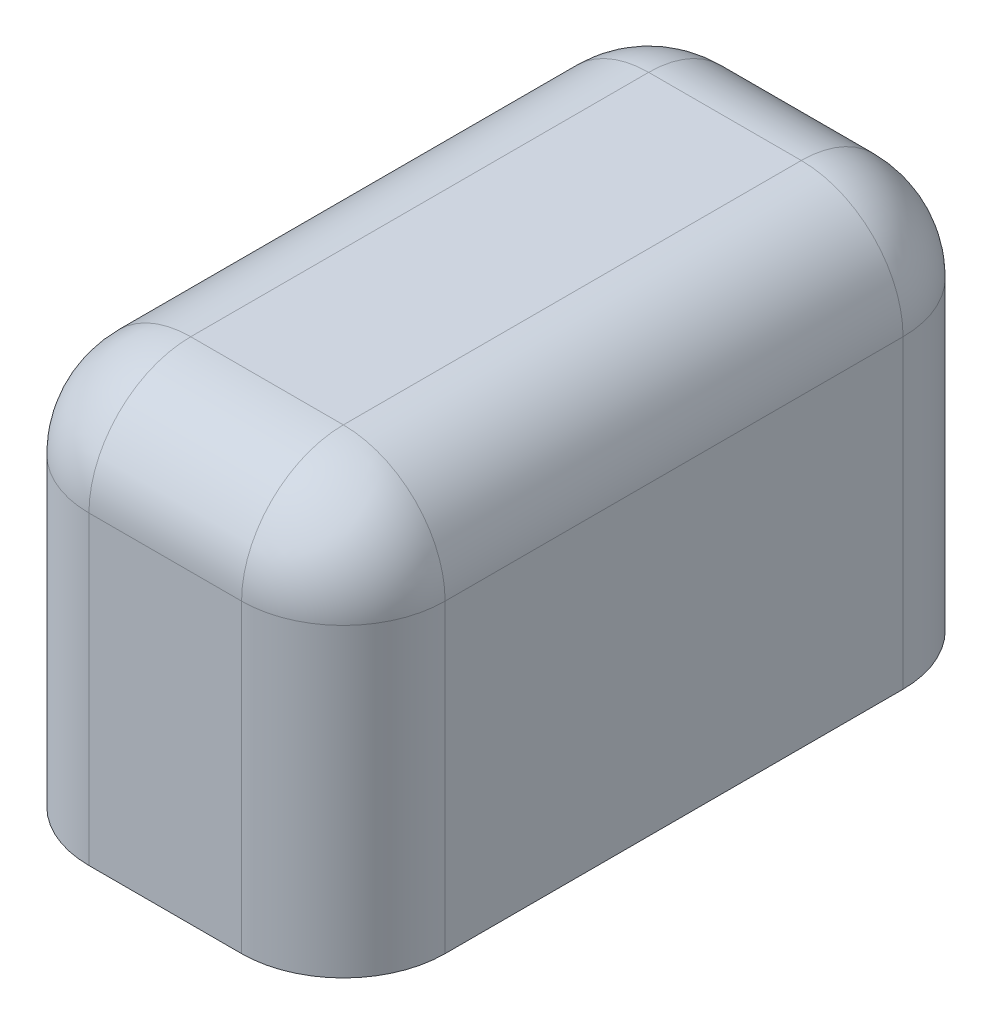
ISO-10303-21;
HEADER;
FILE_DESCRIPTION(('STEP AP214'),'2;1');
FILE_NAME('part.step','',(''),(''),'','','');
FILE_SCHEMA(('AUTOMOTIVE_DESIGN { 1 0 10303 214 1 1 1 1 }'));
ENDSEC;
DATA;
#1=APPLICATION_CONTEXT('core data for automotive mechanical design processes');
#2=APPLICATION_PROTOCOL_DEFINITION('international standard','automotive_design',2000,#1);
#3=PRODUCT_CONTEXT('',#1,'mechanical');
#4=PRODUCT('Part','Part','',(#3));
#5=PRODUCT_RELATED_PRODUCT_CATEGORY('part','',(#4));
#6=PRODUCT_DEFINITION_FORMATION('','',#4);
#7=PRODUCT_DEFINITION_CONTEXT('part definition',#1,'design');
#8=PRODUCT_DEFINITION('design','',#6,#7);
#9=PRODUCT_DEFINITION_SHAPE('','',#8);
#10=(LENGTH_UNIT() NAMED_UNIT(*) SI_UNIT(.MILLI.,.METRE.));
#11=(NAMED_UNIT(*) PLANE_ANGLE_UNIT() SI_UNIT($,.RADIAN.));
#12=(NAMED_UNIT(*) SI_UNIT($,.STERADIAN.) SOLID_ANGLE_UNIT());
#13=UNCERTAINTY_MEASURE_WITH_UNIT(LENGTH_MEASURE(1.E-05),#10,'distance_accuracy_value','');
#14=(GEOMETRIC_REPRESENTATION_CONTEXT(3) GLOBAL_UNCERTAINTY_ASSIGNED_CONTEXT((#13)) GLOBAL_UNIT_ASSIGNED_CONTEXT((#10,
#11,#12)) REPRESENTATION_CONTEXT('',''));
#15=CARTESIAN_POINT('',(0.,0.,0.));
#16=DIRECTION('',(0.,0.,1.));
#17=DIRECTION('',(1.,0.,0.));
#18=AXIS2_PLACEMENT_3D('',#15,#16,#17);
#19=CARTESIAN_POINT('',(4.445,0.,0.));
#20=DIRECTION('',(0.,0.,-1.));
#21=DIRECTION('',(-1.,0.,0.));
#22=AXIS2_PLACEMENT_3D('',#19,#20,#21);
#23=PLANE('',#22);
#24=DIRECTION('',(-1.,0.,0.));
#25=VECTOR('',#24,1.);
#26=CARTESIAN_POINT('',(4.445,7.62,0.));
#27=LINE('',#26,#25);
#28=CARTESIAN_POINT('',(1.905,7.62,0.));
#29=VERTEX_POINT('',#28);
#30=CARTESIAN_POINT('',(-1.905,7.62,0.));
#31=VERTEX_POINT('',#30);
#32=EDGE_CURVE('E135',#29,#31,#27,.T.);
#33=ORIENTED_EDGE('',*,*,#32,.T.);
#34=DIRECTION('',(0.,-1.,0.));
#35=VECTOR('',#34,1.);
#36=CARTESIAN_POINT('',(-1.905,0.,0.));
#37=LINE('',#36,#35);
#38=CARTESIAN_POINT('',(-1.905,0.,0.));
#39=VERTEX_POINT('',#38);
#40=EDGE_CURVE('E177',#31,#39,#37,.T.);
#41=ORIENTED_EDGE('',*,*,#40,.T.);
#42=DIRECTION('',(-1.,0.,0.));
#43=VECTOR('',#42,1.);
#44=CARTESIAN_POINT('',(4.445,0.,0.));
#45=LINE('',#44,#43);
#46=CARTESIAN_POINT('',(1.905,0.,0.));
#47=VERTEX_POINT('',#46);
#48=EDGE_CURVE('E151',#47,#39,#45,.T.);
#49=ORIENTED_EDGE('',*,*,#48,.F.);
#50=DIRECTION('',(0.,-1.,0.));
#51=VECTOR('',#50,1.);
#52=CARTESIAN_POINT('',(1.905,0.,0.));
#53=LINE('',#52,#51);
#54=EDGE_CURVE('E174',#47,#29,#53,.F.);
#55=ORIENTED_EDGE('',*,*,#54,.T.);
#56=EDGE_LOOP('',(#33,#41,#49,#55));
#57=FACE_BOUND('',#56,.T.);
#58=ADVANCED_FACE('F41',(#57),#23,.F.);
#59=CARTESIAN_POINT('',(4.445,0.,0.));
#60=DIRECTION('',(0.,1.,0.));
#61=DIRECTION('',(0.,0.,1.));
#62=AXIS2_PLACEMENT_3D('',#59,#60,#61);
#63=PLANE('',#62);
#64=DIRECTION('',(-1.,0.,0.));
#65=VECTOR('',#64,1.);
#66=CARTESIAN_POINT('',(4.445,0.,-16.51));
#67=LINE('',#66,#65);
#68=CARTESIAN_POINT('',(1.905,0.,-16.51));
#69=VERTEX_POINT('',#68);
#70=CARTESIAN_POINT('',(-1.905,0.,-16.51));
#71=VERTEX_POINT('',#70);
#72=EDGE_CURVE('E154',#69,#71,#67,.T.);
#73=ORIENTED_EDGE('',*,*,#72,.F.);
#74=CARTESIAN_POINT('',(1.905,0.,-13.97));
#75=DIRECTION('',(0.,1.,0.));
#76=DIRECTION('',(0.,0.,1.));
#77=AXIS2_PLACEMENT_3D('',#74,#75,#76);
#78=CIRCLE('',#77,2.54);
#79=CARTESIAN_POINT('',(4.445,0.,-13.97));
#80=VERTEX_POINT('',#79);
#81=EDGE_CURVE('E11',#69,#80,#78,.F.);
#82=ORIENTED_EDGE('',*,*,#81,.T.);
#83=DIRECTION('',(0.,0.,-1.));
#84=VECTOR('',#83,1.);
#85=CARTESIAN_POINT('',(4.445,0.,0.));
#86=LINE('',#85,#84);
#87=CARTESIAN_POINT('',(4.445,0.,-2.54));
#88=VERTEX_POINT('',#87);
#89=EDGE_CURVE('E235',#88,#80,#86,.T.);
#90=ORIENTED_EDGE('',*,*,#89,.F.);
#91=CARTESIAN_POINT('',(1.905,0.,-2.54));
#92=DIRECTION('',(0.,1.,0.));
#93=DIRECTION('',(0.,0.,1.));
#94=AXIS2_PLACEMENT_3D('',#91,#92,#93);
#95=CIRCLE('',#94,2.54);
#96=EDGE_CURVE('E183',#88,#47,#95,.F.);
#97=ORIENTED_EDGE('',*,*,#96,.T.);
#98=ORIENTED_EDGE('',*,*,#48,.T.);
#99=CARTESIAN_POINT('',(-1.905,0.,-2.54));
#100=DIRECTION('',(0.,1.,0.));
#101=DIRECTION('',(0.,0.,1.));
#102=AXIS2_PLACEMENT_3D('',#99,#100,#101);
#103=CIRCLE('',#102,2.54);
#104=CARTESIAN_POINT('',(-4.445,0.,-2.54));
#105=VERTEX_POINT('',#104);
#106=EDGE_CURVE('E185',#39,#105,#103,.F.);
#107=ORIENTED_EDGE('',*,*,#106,.T.);
#108=DIRECTION('',(0.,0.,-1.));
#109=VECTOR('',#108,1.);
#110=CARTESIAN_POINT('',(-4.445,0.,0.));
#111=LINE('',#110,#109);
#112=CARTESIAN_POINT('',(-4.445,0.,-13.97));
#113=VERTEX_POINT('',#112);
#114=EDGE_CURVE('E231',#105,#113,#111,.T.);
#115=ORIENTED_EDGE('',*,*,#114,.T.);
#116=CARTESIAN_POINT('',(-1.905,0.,-13.97));
#117=DIRECTION('',(0.,1.,0.));
#118=DIRECTION('',(0.,0.,1.));
#119=AXIS2_PLACEMENT_3D('',#116,#117,#118);
#120=CIRCLE('',#119,2.54);
#121=EDGE_CURVE('E50',#113,#71,#120,.F.);
#122=ORIENTED_EDGE('',*,*,#121,.T.);
#123=EDGE_LOOP('',(#73,#82,#90,#97,#98,#107,#115,#122));
#124=FACE_BOUND('',#123,.T.);
#125=ADVANCED_FACE('F229',(#124),#63,.F.);
#126=CARTESIAN_POINT('',(4.445,0.,-16.51));
#127=DIRECTION('',(0.,0.,1.));
#128=DIRECTION('',(1.,0.,0.));
#129=AXIS2_PLACEMENT_3D('',#126,#127,#128);
#130=PLANE('',#129);
#131=DIRECTION('',(-1.,0.,0.));
#132=VECTOR('',#131,1.);
#133=CARTESIAN_POINT('',(4.445,7.62,-16.51));
#134=LINE('',#133,#132);
#135=CARTESIAN_POINT('',(-1.905,7.62,-16.51));
#136=VERTEX_POINT('',#135);
#137=CARTESIAN_POINT('',(1.905,7.62,-16.51));
#138=VERTEX_POINT('',#137);
#139=EDGE_CURVE('E163',#136,#138,#134,.F.);
#140=ORIENTED_EDGE('',*,*,#139,.T.);
#141=DIRECTION('',(0.,1.,0.));
#142=VECTOR('',#141,1.);
#143=CARTESIAN_POINT('',(1.905,0.,-16.51));
#144=LINE('',#143,#142);
#145=EDGE_CURVE('E166',#138,#69,#144,.F.);
#146=ORIENTED_EDGE('',*,*,#145,.T.);
#147=ORIENTED_EDGE('',*,*,#72,.T.);
#148=DIRECTION('',(0.,1.,0.));
#149=VECTOR('',#148,1.);
#150=CARTESIAN_POINT('',(-1.905,10.16,-16.51));
#151=LINE('',#150,#149);
#152=EDGE_CURVE('E161',#71,#136,#151,.T.);
#153=ORIENTED_EDGE('',*,*,#152,.T.);
#154=EDGE_LOOP('',(#140,#146,#147,#153));
#155=FACE_BOUND('',#154,.T.);
#156=ADVANCED_FACE('F233',(#155),#130,.F.);
#157=CARTESIAN_POINT('',(4.445,10.16,0.));
#158=DIRECTION('',(0.,-1.,0.));
#159=DIRECTION('',(0.,0.,-1.));
#160=AXIS2_PLACEMENT_3D('',#157,#158,#159);
#161=PLANE('',#160);
#162=DIRECTION('',(0.,0.,1.));
#163=VECTOR('',#162,1.);
#164=CARTESIAN_POINT('',(1.905,10.16,0.));
#165=LINE('',#164,#163);
#166=CARTESIAN_POINT('',(1.905,10.16,-2.54));
#167=VERTEX_POINT('',#166);
#168=CARTESIAN_POINT('',(1.905,10.16,-13.97));
#169=VERTEX_POINT('',#168);
#170=EDGE_CURVE('E122',#167,#169,#165,.F.);
#171=ORIENTED_EDGE('',*,*,#170,.T.);
#172=DIRECTION('',(-1.,0.,0.));
#173=VECTOR('',#172,1.);
#174=CARTESIAN_POINT('',(4.445,10.16,-13.97));
#175=LINE('',#174,#173);
#176=CARTESIAN_POINT('',(-1.905,10.16,-13.97));
#177=VERTEX_POINT('',#176);
#178=EDGE_CURVE('E159',#169,#177,#175,.T.);
#179=ORIENTED_EDGE('',*,*,#178,.T.);
#180=DIRECTION('',(0.,0.,1.));
#181=VECTOR('',#180,1.);
#182=CARTESIAN_POINT('',(-1.905,10.16,0.));
#183=LINE('',#182,#181);
#184=CARTESIAN_POINT('',(-1.905,10.16,-2.54));
#185=VERTEX_POINT('',#184);
#186=EDGE_CURVE('E125',#177,#185,#183,.T.);
#187=ORIENTED_EDGE('',*,*,#186,.T.);
#188=DIRECTION('',(-1.,0.,0.));
#189=VECTOR('',#188,1.);
#190=CARTESIAN_POINT('',(4.445,10.16,-2.54));
#191=LINE('',#190,#189);
#192=EDGE_CURVE('E117',#185,#167,#191,.F.);
#193=ORIENTED_EDGE('',*,*,#192,.T.);
#194=EDGE_LOOP('',(#171,#179,#187,#193));
#195=FACE_BOUND('',#194,.T.);
#196=ADVANCED_FACE('F119',(#195),#161,.F.);
#197=CARTESIAN_POINT('',(4.445,0.,0.));
#198=DIRECTION('',(-1.,0.,0.));
#199=DIRECTION('',(0.,0.,1.));
#200=AXIS2_PLACEMENT_3D('',#197,#198,#199);
#201=PLANE('',#200);
#202=ORIENTED_EDGE('',*,*,#89,.T.);
#203=DIRECTION('',(0.,1.,0.));
#204=VECTOR('',#203,1.);
#205=CARTESIAN_POINT('',(4.445,0.,-13.97));
#206=LINE('',#205,#204);
#207=CARTESIAN_POINT('',(4.445,7.62,-13.97));
#208=VERTEX_POINT('',#207);
#209=EDGE_CURVE('E58',#80,#208,#206,.T.);
#210=ORIENTED_EDGE('',*,*,#209,.T.);
#211=DIRECTION('',(0.,0.,1.));
#212=VECTOR('',#211,1.);
#213=CARTESIAN_POINT('',(4.445,7.62,0.));
#214=LINE('',#213,#212);
#215=CARTESIAN_POINT('',(4.445,7.62,-2.54));
#216=VERTEX_POINT('',#215);
#217=EDGE_CURVE('E62',#208,#216,#214,.T.);
#218=ORIENTED_EDGE('',*,*,#217,.T.);
#219=DIRECTION('',(0.,-1.,0.));
#220=VECTOR('',#219,1.);
#221=CARTESIAN_POINT('',(4.445,0.,-2.54));
#222=LINE('',#221,#220);
#223=EDGE_CURVE('E179',#216,#88,#222,.T.);
#224=ORIENTED_EDGE('',*,*,#223,.T.);
#225=EDGE_LOOP('',(#202,#210,#218,#224));
#226=FACE_BOUND('',#225,.T.);
#227=ADVANCED_FACE('F239',(#226),#201,.F.);
#228=CARTESIAN_POINT('',(-4.445,0.,0.));
#229=DIRECTION('',(-1.,0.,0.));
#230=DIRECTION('',(0.,0.,1.));
#231=AXIS2_PLACEMENT_3D('',#228,#229,#230);
#232=PLANE('',#231);
#233=DIRECTION('',(0.,0.,1.));
#234=VECTOR('',#233,1.);
#235=CARTESIAN_POINT('',(-4.445,7.62,-16.51));
#236=LINE('',#235,#234);
#237=CARTESIAN_POINT('',(-4.445,7.62,-2.54));
#238=VERTEX_POINT('',#237);
#239=CARTESIAN_POINT('',(-4.445,7.62,-13.97));
#240=VERTEX_POINT('',#239);
#241=EDGE_CURVE('E170',#238,#240,#236,.F.);
#242=ORIENTED_EDGE('',*,*,#241,.T.);
#243=DIRECTION('',(0.,1.,0.));
#244=VECTOR('',#243,1.);
#245=CARTESIAN_POINT('',(-4.445,0.,-13.97));
#246=LINE('',#245,#244);
#247=EDGE_CURVE('E172',#240,#113,#246,.F.);
#248=ORIENTED_EDGE('',*,*,#247,.T.);
#249=ORIENTED_EDGE('',*,*,#114,.F.);
#250=DIRECTION('',(0.,-1.,0.));
#251=VECTOR('',#250,1.);
#252=CARTESIAN_POINT('',(-4.445,10.16,-2.54));
#253=LINE('',#252,#251);
#254=EDGE_CURVE('E168',#105,#238,#253,.F.);
#255=ORIENTED_EDGE('',*,*,#254,.T.);
#256=EDGE_LOOP('',(#242,#248,#249,#255));
#257=FACE_BOUND('',#256,.T.);
#258=ADVANCED_FACE('F216',(#257),#232,.T.);
#259=CARTESIAN_POINT('',(1.905,0.,-2.54));
#260=DIRECTION('',(0.,-1.,0.));
#261=DIRECTION('',(0.,0.,-1.));
#262=AXIS2_PLACEMENT_3D('',#259,#260,#261);
#263=CYLINDRICAL_SURFACE('',#262,2.54);
#264=ORIENTED_EDGE('',*,*,#96,.F.);
#265=ORIENTED_EDGE('',*,*,#223,.F.);
#266=CARTESIAN_POINT('',(1.905,7.62,-2.54));
#267=DIRECTION('',(0.,1.,0.));
#268=DIRECTION('',(0.,0.,1.));
#269=AXIS2_PLACEMENT_3D('',#266,#267,#268);
#270=CIRCLE('',#269,2.54);
#271=EDGE_CURVE('E45',#29,#216,#270,.T.);
#272=ORIENTED_EDGE('',*,*,#271,.F.);
#273=ORIENTED_EDGE('',*,*,#54,.F.);
#274=EDGE_LOOP('',(#264,#265,#272,#273));
#275=FACE_BOUND('',#274,.T.);
#276=ADVANCED_FACE('F43',(#275),#263,.T.);
#277=CARTESIAN_POINT('',(4.445,7.62,-2.54));
#278=DIRECTION('',(-1.,0.,0.));
#279=DIRECTION('',(0.,0.,1.));
#280=AXIS2_PLACEMENT_3D('',#277,#278,#279);
#281=CYLINDRICAL_SURFACE('',#280,2.54);
#282=CARTESIAN_POINT('',(-1.905,7.62,-2.54));
#283=DIRECTION('',(-1.,0.,0.));
#284=DIRECTION('',(0.,0.,1.));
#285=AXIS2_PLACEMENT_3D('',#282,#283,#284);
#286=CIRCLE('',#285,2.54);
#287=EDGE_CURVE('E139',#31,#185,#286,.T.);
#288=ORIENTED_EDGE('',*,*,#287,.F.);
#289=ORIENTED_EDGE('',*,*,#32,.F.);
#290=CARTESIAN_POINT('',(1.905,7.62,-2.54));
#291=DIRECTION('',(1.,0.,0.));
#292=DIRECTION('',(0.,0.,-1.));
#293=AXIS2_PLACEMENT_3D('',#290,#291,#292);
#294=CIRCLE('',#293,2.54);
#295=EDGE_CURVE('E132',#167,#29,#294,.T.);
#296=ORIENTED_EDGE('',*,*,#295,.F.);
#297=ORIENTED_EDGE('',*,*,#192,.F.);
#298=EDGE_LOOP('',(#288,#289,#296,#297));
#299=FACE_BOUND('',#298,.T.);
#300=ADVANCED_FACE('F134',(#299),#281,.T.);
#301=CARTESIAN_POINT('',(-1.905,0.,-2.54));
#302=DIRECTION('',(0.,1.,0.));
#303=DIRECTION('',(0.,0.,1.));
#304=AXIS2_PLACEMENT_3D('',#301,#302,#303);
#305=CYLINDRICAL_SURFACE('',#304,2.54);
#306=ORIENTED_EDGE('',*,*,#106,.F.);
#307=ORIENTED_EDGE('',*,*,#40,.F.);
#308=CARTESIAN_POINT('',(-1.905,7.62,-2.54));
#309=DIRECTION('',(0.,1.,0.));
#310=DIRECTION('',(0.,0.,1.));
#311=AXIS2_PLACEMENT_3D('',#308,#309,#310);
#312=CIRCLE('',#311,2.54);
#313=EDGE_CURVE('E144',#238,#31,#312,.T.);
#314=ORIENTED_EDGE('',*,*,#313,.F.);
#315=ORIENTED_EDGE('',*,*,#254,.F.);
#316=EDGE_LOOP('',(#306,#307,#314,#315));
#317=FACE_BOUND('',#316,.T.);
#318=ADVANCED_FACE('F295',(#317),#305,.T.);
#319=CARTESIAN_POINT('',(1.905,7.62,-2.54));
#320=DIRECTION('',(0.,0.,1.));
#321=DIRECTION('',(1.,0.,0.));
#322=AXIS2_PLACEMENT_3D('',#319,#320,#321);
#323=SPHERICAL_SURFACE('',#322,2.54);
#324=ORIENTED_EDGE('',*,*,#295,.T.);
#325=ORIENTED_EDGE('',*,*,#271,.T.);
#326=CARTESIAN_POINT('',(1.905,7.62,-2.54));
#327=DIRECTION('',(0.,0.,1.));
#328=DIRECTION('',(1.,0.,0.));
#329=AXIS2_PLACEMENT_3D('',#326,#327,#328);
#330=CIRCLE('',#329,2.54);
#331=EDGE_CURVE('E141',#167,#216,#330,.F.);
#332=ORIENTED_EDGE('',*,*,#331,.F.);
#333=EDGE_LOOP('',(#324,#325,#332));
#334=FACE_BOUND('',#333,.T.);
#335=ADVANCED_FACE('F142',(#334),#323,.T.);
#336=CARTESIAN_POINT('',(-1.905,7.62,-2.54));
#337=DIRECTION('',(0.,0.,1.));
#338=DIRECTION('',(1.,0.,0.));
#339=AXIS2_PLACEMENT_3D('',#336,#337,#338);
#340=SPHERICAL_SURFACE('',#339,2.54);
#341=ORIENTED_EDGE('',*,*,#313,.T.);
#342=ORIENTED_EDGE('',*,*,#287,.T.);
#343=CARTESIAN_POINT('',(-1.905,7.62,-2.54));
#344=DIRECTION('',(0.,0.,1.));
#345=DIRECTION('',(1.,0.,0.));
#346=AXIS2_PLACEMENT_3D('',#343,#344,#345);
#347=CIRCLE('',#346,2.54);
#348=EDGE_CURVE('E145',#238,#185,#347,.F.);
#349=ORIENTED_EDGE('',*,*,#348,.F.);
#350=EDGE_LOOP('',(#341,#342,#349));
#351=FACE_BOUND('',#350,.T.);
#352=ADVANCED_FACE('F208',(#351),#340,.T.);
#353=CARTESIAN_POINT('',(1.905,0.,-13.97));
#354=DIRECTION('',(0.,1.,0.));
#355=DIRECTION('',(0.,0.,1.));
#356=AXIS2_PLACEMENT_3D('',#353,#354,#355);
#357=CYLINDRICAL_SURFACE('',#356,2.54);
#358=ORIENTED_EDGE('',*,*,#81,.F.);
#359=ORIENTED_EDGE('',*,*,#145,.F.);
#360=CARTESIAN_POINT('',(1.905,7.62,-13.97));
#361=DIRECTION('',(0.,1.,0.));
#362=DIRECTION('',(0.,0.,1.));
#363=AXIS2_PLACEMENT_3D('',#360,#361,#362);
#364=CIRCLE('',#363,2.54);
#365=EDGE_CURVE('E199',#208,#138,#364,.T.);
#366=ORIENTED_EDGE('',*,*,#365,.F.);
#367=ORIENTED_EDGE('',*,*,#209,.F.);
#368=EDGE_LOOP('',(#358,#359,#366,#367));
#369=FACE_BOUND('',#368,.T.);
#370=ADVANCED_FACE('F243',(#369),#357,.T.);
#371=CARTESIAN_POINT('',(1.905,7.62,0.));
#372=DIRECTION('',(0.,0.,1.));
#373=DIRECTION('',(1.,0.,0.));
#374=AXIS2_PLACEMENT_3D('',#371,#372,#373);
#375=CYLINDRICAL_SURFACE('',#374,2.54);
#376=ORIENTED_EDGE('',*,*,#331,.T.);
#377=ORIENTED_EDGE('',*,*,#217,.F.);
#378=CARTESIAN_POINT('',(1.905,7.62,-13.97));
#379=DIRECTION('',(0.,0.,-1.));
#380=DIRECTION('',(-1.,0.,0.));
#381=AXIS2_PLACEMENT_3D('',#378,#379,#380);
#382=CIRCLE('',#381,2.54);
#383=EDGE_CURVE('E149',#169,#208,#382,.T.);
#384=ORIENTED_EDGE('',*,*,#383,.F.);
#385=ORIENTED_EDGE('',*,*,#170,.F.);
#386=EDGE_LOOP('',(#376,#377,#384,#385));
#387=FACE_BOUND('',#386,.T.);
#388=ADVANCED_FACE('F147',(#387),#375,.T.);
#389=CARTESIAN_POINT('',(-1.905,7.62,0.));
#390=DIRECTION('',(0.,0.,-1.));
#391=DIRECTION('',(-1.,0.,0.));
#392=AXIS2_PLACEMENT_3D('',#389,#390,#391);
#393=CYLINDRICAL_SURFACE('',#392,2.54);
#394=ORIENTED_EDGE('',*,*,#348,.T.);
#395=ORIENTED_EDGE('',*,*,#186,.F.);
#396=CARTESIAN_POINT('',(-1.905,7.62,-13.97));
#397=DIRECTION('',(0.,0.,-1.));
#398=DIRECTION('',(-1.,0.,0.));
#399=AXIS2_PLACEMENT_3D('',#396,#397,#398);
#400=CIRCLE('',#399,2.54);
#401=EDGE_CURVE('E195',#240,#177,#400,.T.);
#402=ORIENTED_EDGE('',*,*,#401,.F.);
#403=ORIENTED_EDGE('',*,*,#241,.F.);
#404=EDGE_LOOP('',(#394,#395,#402,#403));
#405=FACE_BOUND('',#404,.T.);
#406=ADVANCED_FACE('F212',(#405),#393,.T.);
#407=CARTESIAN_POINT('',(-1.905,0.,-13.97));
#408=DIRECTION('',(0.,-1.,0.));
#409=DIRECTION('',(0.,0.,-1.));
#410=AXIS2_PLACEMENT_3D('',#407,#408,#409);
#411=CYLINDRICAL_SURFACE('',#410,2.54);
#412=ORIENTED_EDGE('',*,*,#121,.F.);
#413=ORIENTED_EDGE('',*,*,#247,.F.);
#414=CARTESIAN_POINT('',(-1.905,7.62,-13.97));
#415=DIRECTION('',(0.,1.,0.));
#416=DIRECTION('',(0.,0.,1.));
#417=AXIS2_PLACEMENT_3D('',#414,#415,#416);
#418=CIRCLE('',#417,2.54);
#419=EDGE_CURVE('E192',#136,#240,#418,.T.);
#420=ORIENTED_EDGE('',*,*,#419,.F.);
#421=ORIENTED_EDGE('',*,*,#152,.F.);
#422=EDGE_LOOP('',(#412,#413,#420,#421));
#423=FACE_BOUND('',#422,.T.);
#424=ADVANCED_FACE('F223',(#423),#411,.T.);
#425=CARTESIAN_POINT('',(1.905,7.62,-13.97));
#426=DIRECTION('',(1.,0.,0.));
#427=DIRECTION('',(0.,0.,-1.));
#428=AXIS2_PLACEMENT_3D('',#425,#426,#427);
#429=SPHERICAL_SURFACE('',#428,2.54);
#430=ORIENTED_EDGE('',*,*,#383,.T.);
#431=ORIENTED_EDGE('',*,*,#365,.T.);
#432=CARTESIAN_POINT('',(1.905,7.62,-13.97));
#433=DIRECTION('',(1.,0.,0.));
#434=DIRECTION('',(0.,0.,-1.));
#435=AXIS2_PLACEMENT_3D('',#432,#433,#434);
#436=CIRCLE('',#435,2.54);
#437=EDGE_CURVE('E190',#169,#138,#436,.F.);
#438=ORIENTED_EDGE('',*,*,#437,.F.);
#439=EDGE_LOOP('',(#430,#431,#438));
#440=FACE_BOUND('',#439,.T.);
#441=ADVANCED_FACE('F245',(#440),#429,.T.);
#442=CARTESIAN_POINT('',(-1.905,7.62,-13.97));
#443=DIRECTION('',(-1.,0.,0.));
#444=DIRECTION('',(0.,0.,1.));
#445=AXIS2_PLACEMENT_3D('',#442,#443,#444);
#446=SPHERICAL_SURFACE('',#445,2.54);
#447=ORIENTED_EDGE('',*,*,#419,.T.);
#448=ORIENTED_EDGE('',*,*,#401,.T.);
#449=CARTESIAN_POINT('',(-1.905,7.62,-13.97));
#450=DIRECTION('',(-1.,0.,0.));
#451=DIRECTION('',(0.,0.,1.));
#452=AXIS2_PLACEMENT_3D('',#449,#450,#451);
#453=CIRCLE('',#452,2.54);
#454=EDGE_CURVE('E188',#136,#177,#453,.F.);
#455=ORIENTED_EDGE('',*,*,#454,.F.);
#456=EDGE_LOOP('',(#447,#448,#455));
#457=FACE_BOUND('',#456,.T.);
#458=ADVANCED_FACE('F251',(#457),#446,.T.);
#459=CARTESIAN_POINT('',(4.445,7.62,-13.97));
#460=DIRECTION('',(-1.,0.,0.));
#461=DIRECTION('',(0.,0.,1.));
#462=AXIS2_PLACEMENT_3D('',#459,#460,#461);
#463=CYLINDRICAL_SURFACE('',#462,2.54);
#464=ORIENTED_EDGE('',*,*,#437,.T.);
#465=ORIENTED_EDGE('',*,*,#139,.F.);
#466=ORIENTED_EDGE('',*,*,#454,.T.);
#467=ORIENTED_EDGE('',*,*,#178,.F.);
#468=EDGE_LOOP('',(#464,#465,#466,#467));
#469=FACE_BOUND('',#468,.T.);
#470=ADVANCED_FACE('F248',(#469),#463,.T.);
#471=CLOSED_SHELL('',(#58,#125,#156,#196,#227,#258,#276,#300,#318,#335,#352,#370,#388,#406,#424,
#441,#458,#470));
#472=MANIFOLD_SOLID_BREP('B2',#471);
#473=ADVANCED_BREP_SHAPE_REPRESENTATION('',(#18,#472),#14);
#474=SHAPE_DEFINITION_REPRESENTATION(#9,#473);
ENDSEC;
END-ISO-10303-21;
